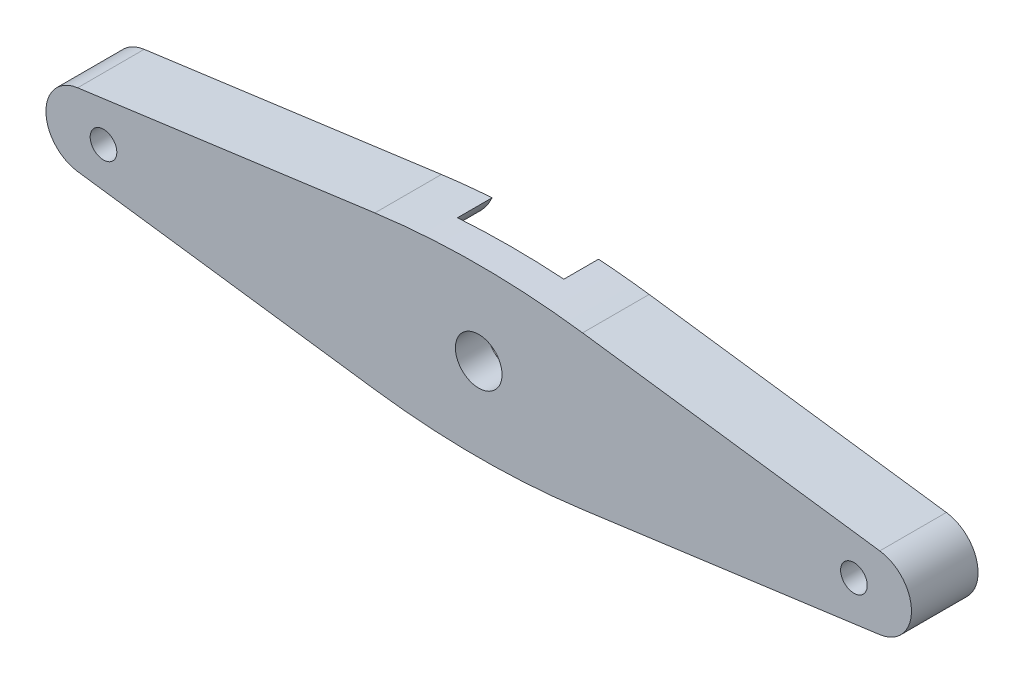
ISO-10303-21;
HEADER;
FILE_DESCRIPTION(('STEP AP214'),'2;1');
FILE_NAME('part.step','',(''),(''),'','','');
FILE_SCHEMA(('AUTOMOTIVE_DESIGN { 1 0 10303 214 1 1 1 1 }'));
ENDSEC;
DATA;
#1=APPLICATION_CONTEXT('core data for automotive mechanical design processes');
#2=APPLICATION_PROTOCOL_DEFINITION('international standard','automotive_design',2000,#1);
#3=PRODUCT_CONTEXT('',#1,'mechanical');
#4=PRODUCT('Part','Part','',(#3));
#5=PRODUCT_RELATED_PRODUCT_CATEGORY('part','',(#4));
#6=PRODUCT_DEFINITION_FORMATION('','',#4);
#7=PRODUCT_DEFINITION_CONTEXT('part definition',#1,'design');
#8=PRODUCT_DEFINITION('design','',#6,#7);
#9=PRODUCT_DEFINITION_SHAPE('','',#8);
#10=(LENGTH_UNIT() NAMED_UNIT(*) SI_UNIT(.MILLI.,.METRE.));
#11=(NAMED_UNIT(*) PLANE_ANGLE_UNIT() SI_UNIT($,.RADIAN.));
#12=(NAMED_UNIT(*) SI_UNIT($,.STERADIAN.) SOLID_ANGLE_UNIT());
#13=UNCERTAINTY_MEASURE_WITH_UNIT(LENGTH_MEASURE(1.E-05),#10,'distance_accuracy_value','');
#14=(GEOMETRIC_REPRESENTATION_CONTEXT(3) GLOBAL_UNCERTAINTY_ASSIGNED_CONTEXT((#13)) GLOBAL_UNIT_ASSIGNED_CONTEXT((#10,
#11,#12)) REPRESENTATION_CONTEXT('',''));
#15=CARTESIAN_POINT('',(0.,0.,0.));
#16=DIRECTION('',(0.,0.,1.));
#17=DIRECTION('',(1.,0.,0.));
#18=AXIS2_PLACEMENT_3D('',#15,#16,#17);
#19=CARTESIAN_POINT('',(18.0000000000003,51.9098389957868,0.));
#20=DIRECTION('',(0.,0.,1.));
#21=DIRECTION('',(1.,0.,0.));
#22=AXIS2_PLACEMENT_3D('',#19,#20,#21);
#23=PLANE('',#22);
#24=CARTESIAN_POINT('',(-10.1769846841459,0.,0.));
#25=DIRECTION('',(0.,0.,1.));
#26=DIRECTION('',(1.,0.,0.));
#27=AXIS2_PLACEMENT_3D('',#24,#25,#26);
#28=CIRCLE('',#27,1.);
#29=CARTESIAN_POINT('',(-9.17698468414593,0.,0.));
#30=VERTEX_POINT('',#29);
#31=EDGE_CURVE('E338',#30,#30,#28,.T.);
#32=ORIENTED_EDGE('',*,*,#31,.T.);
#33=EDGE_LOOP('',(#32));
#34=FACE_BOUND('',#33,.T.);
#35=CARTESIAN_POINT('',(17.9999999999999,-51.9098389957837,0.));
#36=DIRECTION('',(0.,0.,1.));
#37=DIRECTION('',(-1.,0.,0.));
#38=AXIS2_PLACEMENT_3D('',#35,#36,#37);
#39=CIRCLE('',#38,58.179875130031);
#40=CARTESIAN_POINT('',(14.0047957534816,6.13269896711555,0.));
#41=VERTEX_POINT('',#40);
#42=CARTESIAN_POINT('',(10.1995611723666,5.74474472695557,0.));
#43=VERTEX_POINT('',#42);
#44=EDGE_CURVE('E155',#41,#43,#39,.T.);
#45=ORIENTED_EDGE('',*,*,#44,.F.);
#46=CARTESIAN_POINT('',(10.2010065883518,7.79899341164945,0.));
#47=DIRECTION('',(0.,0.,1.));
#48=DIRECTION('',(1.,0.,0.));
#49=AXIS2_PLACEMENT_3D('',#46,#47,#48);
#50=CIRCLE('',#49,4.15275200182277);
#51=CARTESIAN_POINT('',(11.0515587976835,3.73427815374466,0.));
#52=VERTEX_POINT('',#51);
#53=EDGE_CURVE('E304',#52,#41,#50,.T.);
#54=ORIENTED_EDGE('',*,*,#53,.F.);
#55=DIRECTION('',(-0.978800384930441,-0.20481651901158,0.));
#56=VECTOR('',#55,1.);
#57=CARTESIAN_POINT('',(11.0515587976836,3.73427815374461,0.));
#58=LINE('',#57,#56);
#59=CARTESIAN_POINT('',(1.39157109173227,1.71290067362827,0.));
#60=VERTEX_POINT('',#59);
#61=EDGE_CURVE('E301',#52,#60,#58,.T.);
#62=ORIENTED_EDGE('',*,*,#61,.T.);
#63=CARTESIAN_POINT('',(1.75000000000253,0.,0.));
#64=DIRECTION('',(0.,0.,1.));
#65=DIRECTION('',(1.,0.,0.));
#66=AXIS2_PLACEMENT_3D('',#63,#64,#65);
#67=CIRCLE('',#66,1.75);
#68=CARTESIAN_POINT('',(1.39157109173227,-1.71290067362827,0.));
#69=VERTEX_POINT('',#68);
#70=EDGE_CURVE('E294',#60,#69,#67,.T.);
#71=ORIENTED_EDGE('',*,*,#70,.T.);
#72=DIRECTION('',(-0.978800384930439,0.204816519011589,0.));
#73=VECTOR('',#72,1.);
#74=CARTESIAN_POINT('',(11.0515587976835,-3.7342781537447,0.));
#75=LINE('',#74,#73);
#76=CARTESIAN_POINT('',(11.0515587976835,-3.7342781537447,0.));
#77=VERTEX_POINT('',#76);
#78=EDGE_CURVE('E292',#77,#69,#75,.T.);
#79=ORIENTED_EDGE('',*,*,#78,.F.);
#80=CARTESIAN_POINT('',(10.2010065883518,-7.79899341164949,0.));
#81=DIRECTION('',(0.,0.,1.));
#82=DIRECTION('',(1.,0.,0.));
#83=AXIS2_PLACEMENT_3D('',#80,#81,#82);
#84=CIRCLE('',#83,4.15275200182279);
#85=CARTESIAN_POINT('',(14.0047957534815,-6.13269896711555,0.));
#86=VERTEX_POINT('',#85);
#87=EDGE_CURVE('E288',#86,#77,#84,.T.);
#88=ORIENTED_EDGE('',*,*,#87,.F.);
#89=CARTESIAN_POINT('',(18.0000000000003,51.9098389957868,0.));
#90=DIRECTION('',(0.,0.,1.));
#91=DIRECTION('',(1.,0.,0.));
#92=AXIS2_PLACEMENT_3D('',#89,#90,#91);
#93=CIRCLE('',#92,58.1798751300342);
#94=CARTESIAN_POINT('',(10.1995611723666,-5.74474472695556,0.));
#95=VERTEX_POINT('',#94);
#96=EDGE_CURVE('E145',#95,#86,#93,.T.);
#97=ORIENTED_EDGE('',*,*,#96,.F.);
#98=DIRECTION('',(0.99097125241129,-0.134074519929776,0.));
#99=VECTOR('',#98,1.);
#100=CARTESIAN_POINT('',(-12.1187049298069,-2.72517094413105,0.));
#101=LINE('',#100,#99);
#102=CARTESIAN_POINT('',(-12.1187049298069,-2.72517094413105,0.));
#103=VERTEX_POINT('',#102);
#104=EDGE_CURVE('E92',#103,#95,#101,.T.);
#105=ORIENTED_EDGE('',*,*,#104,.F.);
#106=CARTESIAN_POINT('',(-11.75,0.,0.));
#107=DIRECTION('',(0.,0.,1.));
#108=DIRECTION('',(1.,0.,0.));
#109=AXIS2_PLACEMENT_3D('',#106,#107,#108);
#110=CIRCLE('',#109,2.75);
#111=CARTESIAN_POINT('',(-12.1187049298069,2.72517094413105,0.));
#112=VERTEX_POINT('',#111);
#113=EDGE_CURVE('E160',#112,#103,#110,.T.);
#114=ORIENTED_EDGE('',*,*,#113,.F.);
#115=DIRECTION('',(-0.99097125241129,-0.134074519929776,0.));
#116=VECTOR('',#115,1.);
#117=CARTESIAN_POINT('',(-12.1187049298069,2.72517094413105,0.));
#118=LINE('',#117,#116);
#119=EDGE_CURVE('E133',#43,#112,#118,.T.);
#120=ORIENTED_EDGE('',*,*,#119,.F.);
#121=EDGE_LOOP('',(#45,#54,#62,#71,#79,#88,#97,#105,#114,#120));
#122=FACE_BOUND('',#121,.T.);
#123=ADVANCED_FACE('F34',(#34,#122),#23,.F.);
#124=CARTESIAN_POINT('',(18.0000000000003,51.9098389957868,5.));
#125=DIRECTION('',(0.,0.,1.));
#126=DIRECTION('',(1.,0.,0.));
#127=AXIS2_PLACEMENT_3D('',#124,#125,#126);
#128=PLANE('',#127);
#129=CARTESIAN_POINT('',(-10.1769846841459,0.,5.));
#130=DIRECTION('',(0.,0.,1.));
#131=DIRECTION('',(1.,0.,0.));
#132=AXIS2_PLACEMENT_3D('',#129,#130,#131);
#133=CIRCLE('',#132,1.);
#134=CARTESIAN_POINT('',(-9.17698468414593,0.,5.));
#135=VERTEX_POINT('',#134);
#136=EDGE_CURVE('E430',#135,#135,#133,.T.);
#137=ORIENTED_EDGE('',*,*,#136,.F.);
#138=EDGE_LOOP('',(#137));
#139=FACE_BOUND('',#138,.T.);
#140=CARTESIAN_POINT('',(46.1769846841459,0.,5.));
#141=DIRECTION('',(0.,0.,1.));
#142=DIRECTION('',(-1.,0.,0.));
#143=AXIS2_PLACEMENT_3D('',#140,#141,#142);
#144=CIRCLE('',#143,0.999999999999998);
#145=CARTESIAN_POINT('',(45.1769846841459,0.,5.));
#146=VERTEX_POINT('',#145);
#147=EDGE_CURVE('E432',#146,#146,#144,.T.);
#148=ORIENTED_EDGE('',*,*,#147,.F.);
#149=EDGE_LOOP('',(#148));
#150=FACE_BOUND('',#149,.T.);
#151=CARTESIAN_POINT('',(18.0000000000003,51.9098389957868,5.));
#152=DIRECTION('',(0.,0.,1.));
#153=DIRECTION('',(1.,0.,0.));
#154=AXIS2_PLACEMENT_3D('',#151,#152,#153);
#155=CIRCLE('',#154,58.1798751300342);
#156=CARTESIAN_POINT('',(10.1995611723666,-5.74474472695556,5.));
#157=VERTEX_POINT('',#156);
#158=CARTESIAN_POINT('',(25.8004388276333,-5.74474472695563,5.));
#159=VERTEX_POINT('',#158);
#160=EDGE_CURVE('E163',#157,#159,#155,.T.);
#161=ORIENTED_EDGE('',*,*,#160,.T.);
#162=DIRECTION('',(0.990971252411291,0.134074519929769,0.));
#163=VECTOR('',#162,1.);
#164=CARTESIAN_POINT('',(48.1187049298069,-2.72517094413126,5.));
#165=LINE('',#164,#163);
#166=CARTESIAN_POINT('',(48.1187049298069,-2.72517094413126,5.));
#167=VERTEX_POINT('',#166);
#168=EDGE_CURVE('E101',#159,#167,#165,.T.);
#169=ORIENTED_EDGE('',*,*,#168,.T.);
#170=CARTESIAN_POINT('',(47.75,-2.08684625209121E-13,5.));
#171=DIRECTION('',(0.,0.,1.));
#172=DIRECTION('',(1.,0.,0.));
#173=AXIS2_PLACEMENT_3D('',#170,#171,#172);
#174=CIRCLE('',#173,2.75);
#175=CARTESIAN_POINT('',(48.1187049298069,2.72517094413083,5.));
#176=VERTEX_POINT('',#175);
#177=EDGE_CURVE('E224',#167,#176,#174,.T.);
#178=ORIENTED_EDGE('',*,*,#177,.T.);
#179=DIRECTION('',(-0.990971252411289,0.134074519929783,0.));
#180=VECTOR('',#179,1.);
#181=CARTESIAN_POINT('',(48.1187049298069,2.72517094413083,5.));
#182=LINE('',#181,#180);
#183=CARTESIAN_POINT('',(25.8004388276334,5.74474472695551,5.));
#184=VERTEX_POINT('',#183);
#185=EDGE_CURVE('E226',#176,#184,#182,.T.);
#186=ORIENTED_EDGE('',*,*,#185,.T.);
#187=CARTESIAN_POINT('',(17.9999999999999,-51.9098389957837,5.));
#188=DIRECTION('',(0.,0.,1.));
#189=DIRECTION('',(-1.,0.,0.));
#190=AXIS2_PLACEMENT_3D('',#187,#188,#189);
#191=CIRCLE('',#190,58.179875130031);
#192=CARTESIAN_POINT('',(10.1995611723666,5.74474472695557,5.));
#193=VERTEX_POINT('',#192);
#194=EDGE_CURVE('E124',#184,#193,#191,.T.);
#195=ORIENTED_EDGE('',*,*,#194,.T.);
#196=DIRECTION('',(-0.99097125241129,-0.134074519929776,0.));
#197=VECTOR('',#196,1.);
#198=CARTESIAN_POINT('',(-12.1187049298069,2.72517094413105,5.));
#199=LINE('',#198,#197);
#200=CARTESIAN_POINT('',(-12.1187049298069,2.72517094413105,5.));
#201=VERTEX_POINT('',#200);
#202=EDGE_CURVE('E116',#193,#201,#199,.T.);
#203=ORIENTED_EDGE('',*,*,#202,.T.);
#204=CARTESIAN_POINT('',(-11.75,0.,5.));
#205=DIRECTION('',(0.,0.,1.));
#206=DIRECTION('',(1.,0.,0.));
#207=AXIS2_PLACEMENT_3D('',#204,#205,#206);
#208=CIRCLE('',#207,2.75);
#209=CARTESIAN_POINT('',(-12.1187049298069,-2.72517094413105,5.));
#210=VERTEX_POINT('',#209);
#211=EDGE_CURVE('E121',#201,#210,#208,.T.);
#212=ORIENTED_EDGE('',*,*,#211,.T.);
#213=DIRECTION('',(0.99097125241129,-0.134074519929776,0.));
#214=VECTOR('',#213,1.);
#215=CARTESIAN_POINT('',(-12.1187049298069,-2.72517094413105,5.));
#216=LINE('',#215,#214);
#217=EDGE_CURVE('E59',#210,#157,#216,.T.);
#218=ORIENTED_EDGE('',*,*,#217,.T.);
#219=EDGE_LOOP('',(#161,#169,#178,#186,#195,#203,#212,#218));
#220=FACE_BOUND('',#219,.T.);
#221=CARTESIAN_POINT('',(18.,0.,5.));
#222=DIRECTION('',(0.,0.,1.));
#223=DIRECTION('',(1.,0.,0.));
#224=AXIS2_PLACEMENT_3D('',#221,#222,#223);
#225=CIRCLE('',#224,1.75);
#226=CARTESIAN_POINT('',(19.75,0.,5.));
#227=VERTEX_POINT('',#226);
#228=EDGE_CURVE('E214',#227,#227,#225,.T.);
#229=ORIENTED_EDGE('',*,*,#228,.F.);
#230=EDGE_LOOP('',(#229));
#231=FACE_BOUND('',#230,.T.);
#232=ADVANCED_FACE('F118',(#139,#150,#220,#231),#128,.T.);
#233=CARTESIAN_POINT('',(46.1769846841459,0.,0.));
#234=DIRECTION('',(0.,0.,1.));
#235=DIRECTION('',(1.,0.,0.));
#236=AXIS2_PLACEMENT_3D('',#233,#234,#235);
#237=CIRCLE('',#236,0.999999999999998);
#238=CARTESIAN_POINT('',(47.1769846841459,0.,0.));
#239=VERTEX_POINT('',#238);
#240=EDGE_CURVE('E38',#239,#239,#237,.T.);
#241=ORIENTED_EDGE('',*,*,#240,.T.);
#242=EDGE_LOOP('',(#241));
#243=FACE_BOUND('',#242,.T.);
#244=DIRECTION('',(0.978800384930441,-0.204816519011576,0.));
#245=VECTOR('',#244,1.);
#246=CARTESIAN_POINT('',(24.948441202319,3.73427815374457,0.));
#247=LINE('',#246,#245);
#248=CARTESIAN_POINT('',(24.948441202319,3.73427815374457,0.));
#249=VERTEX_POINT('',#248);
#250=CARTESIAN_POINT('',(34.6084289082703,1.71290067362827,0.));
#251=VERTEX_POINT('',#250);
#252=EDGE_CURVE('E356',#249,#251,#247,.T.);
#253=ORIENTED_EDGE('',*,*,#252,.F.);
#254=CARTESIAN_POINT('',(25.7989934116507,7.79899341164945,0.));
#255=DIRECTION('',(0.,0.,1.));
#256=DIRECTION('',(1.,0.,0.));
#257=AXIS2_PLACEMENT_3D('',#254,#255,#256);
#258=CIRCLE('',#257,4.1527520018228);
#259=CARTESIAN_POINT('',(21.995204246521,6.13269896711535,0.));
#260=VERTEX_POINT('',#259);
#261=EDGE_CURVE('E249',#260,#249,#258,.T.);
#262=ORIENTED_EDGE('',*,*,#261,.F.);
#263=CARTESIAN_POINT('',(25.8004388276334,5.74474472695551,0.));
#264=VERTEX_POINT('',#263);
#265=EDGE_CURVE('E156',#264,#260,#39,.T.);
#266=ORIENTED_EDGE('',*,*,#265,.F.);
#267=DIRECTION('',(-0.990971252411289,0.134074519929783,0.));
#268=VECTOR('',#267,1.);
#269=CARTESIAN_POINT('',(48.1187049298069,2.72517094413083,0.));
#270=LINE('',#269,#268);
#271=CARTESIAN_POINT('',(48.1187049298069,2.72517094413083,0.));
#272=VERTEX_POINT('',#271);
#273=EDGE_CURVE('E153',#272,#264,#270,.T.);
#274=ORIENTED_EDGE('',*,*,#273,.F.);
#275=CARTESIAN_POINT('',(47.75,-2.08684625209121E-13,0.));
#276=DIRECTION('',(0.,0.,1.));
#277=DIRECTION('',(1.,0.,0.));
#278=AXIS2_PLACEMENT_3D('',#275,#276,#277);
#279=CIRCLE('',#278,2.75);
#280=CARTESIAN_POINT('',(48.1187049298069,-2.72517094413126,0.));
#281=VERTEX_POINT('',#280);
#282=EDGE_CURVE('E151',#281,#272,#279,.T.);
#283=ORIENTED_EDGE('',*,*,#282,.F.);
#284=DIRECTION('',(0.990971252411291,0.134074519929769,0.));
#285=VECTOR('',#284,1.);
#286=CARTESIAN_POINT('',(48.1187049298069,-2.72517094413126,0.));
#287=LINE('',#286,#285);
#288=CARTESIAN_POINT('',(25.8004388276333,-5.74474472695563,0.));
#289=VERTEX_POINT('',#288);
#290=EDGE_CURVE('E148',#289,#281,#287,.T.);
#291=ORIENTED_EDGE('',*,*,#290,.F.);
#292=CARTESIAN_POINT('',(21.995204246521,-6.13269896711542,0.));
#293=VERTEX_POINT('',#292);
#294=EDGE_CURVE('E149',#293,#289,#93,.T.);
#295=ORIENTED_EDGE('',*,*,#294,.F.);
#296=CARTESIAN_POINT('',(25.7989934116507,-7.79899341164945,0.));
#297=DIRECTION('',(0.,0.,1.));
#298=DIRECTION('',(1.,0.,0.));
#299=AXIS2_PLACEMENT_3D('',#296,#297,#298);
#300=CIRCLE('',#299,4.1527520018228);
#301=CARTESIAN_POINT('',(24.948441202319,-3.73427815374463,0.));
#302=VERTEX_POINT('',#301);
#303=EDGE_CURVE('E212',#302,#293,#300,.T.);
#304=ORIENTED_EDGE('',*,*,#303,.F.);
#305=DIRECTION('',(0.978800384930441,0.204816519011576,0.));
#306=VECTOR('',#305,1.);
#307=CARTESIAN_POINT('',(24.948441202319,-3.73427815374457,0.));
#308=LINE('',#307,#306);
#309=CARTESIAN_POINT('',(34.6084289082703,-1.71290067362827,0.));
#310=VERTEX_POINT('',#309);
#311=EDGE_CURVE('E296',#302,#310,#308,.T.);
#312=ORIENTED_EDGE('',*,*,#311,.T.);
#313=CARTESIAN_POINT('',(34.25,0.,0.));
#314=DIRECTION('',(0.,0.,1.));
#315=DIRECTION('',(1.,0.,0.));
#316=AXIS2_PLACEMENT_3D('',#313,#314,#315);
#317=CIRCLE('',#316,1.75);
#318=EDGE_CURVE('E359',#310,#251,#317,.T.);
#319=ORIENTED_EDGE('',*,*,#318,.T.);
#320=EDGE_LOOP('',(#253,#262,#266,#274,#283,#291,#295,#304,#312,#319));
#321=FACE_BOUND('',#320,.T.);
#322=ADVANCED_FACE('F209',(#243,#321),#23,.F.);
#323=CARTESIAN_POINT('',(18.0000000000003,51.9098389957868,5.));
#324=DIRECTION('',(0.,0.,-1.));
#325=DIRECTION('',(-1.,0.,0.));
#326=AXIS2_PLACEMENT_3D('',#323,#324,#325);
#327=CYLINDRICAL_SURFACE('',#326,58.1798751300342);
#328=ORIENTED_EDGE('',*,*,#96,.T.);
#329=DIRECTION('',(0.,0.,-1.));
#330=VECTOR('',#329,1.);
#331=CARTESIAN_POINT('',(14.0047957534815,-6.13269896711552,1.3));
#332=LINE('',#331,#330);
#333=CARTESIAN_POINT('',(14.0047957534815,-6.13269896711555,2.6));
#334=VERTEX_POINT('',#333);
#335=EDGE_CURVE('E11',#86,#334,#332,.F.);
#336=ORIENTED_EDGE('',*,*,#335,.T.);
#337=CARTESIAN_POINT('',(18.0000000000003,51.9098389957868,2.6));
#338=DIRECTION('',(0.,0.,1.));
#339=DIRECTION('',(1.,0.,0.));
#340=AXIS2_PLACEMENT_3D('',#337,#338,#339);
#341=CIRCLE('',#340,58.1798751300342);
#342=CARTESIAN_POINT('',(21.995204246521,-6.13269896711542,2.6));
#343=VERTEX_POINT('',#342);
#344=EDGE_CURVE('E198',#334,#343,#341,.T.);
#345=ORIENTED_EDGE('',*,*,#344,.T.);
#346=DIRECTION('',(0.,0.,-1.));
#347=VECTOR('',#346,1.);
#348=CARTESIAN_POINT('',(21.995204246521,-6.13269896711544,1.3));
#349=LINE('',#348,#347);
#350=EDGE_CURVE('E43',#343,#293,#349,.T.);
#351=ORIENTED_EDGE('',*,*,#350,.T.);
#352=ORIENTED_EDGE('',*,*,#294,.T.);
#353=DIRECTION('',(0.,0.,-1.));
#354=VECTOR('',#353,1.);
#355=CARTESIAN_POINT('',(25.8004388276333,-5.74474472695563,5.));
#356=LINE('',#355,#354);
#357=EDGE_CURVE('E176',#159,#289,#356,.T.);
#358=ORIENTED_EDGE('',*,*,#357,.F.);
#359=ORIENTED_EDGE('',*,*,#160,.F.);
#360=DIRECTION('',(0.,0.,-1.));
#361=VECTOR('',#360,1.);
#362=CARTESIAN_POINT('',(10.1995611723666,-5.74474472695556,5.));
#363=LINE('',#362,#361);
#364=EDGE_CURVE('E141',#157,#95,#363,.T.);
#365=ORIENTED_EDGE('',*,*,#364,.T.);
#366=EDGE_LOOP('',(#328,#336,#345,#351,#352,#358,#359,#365));
#367=FACE_BOUND('',#366,.T.);
#368=ADVANCED_FACE('F36',(#367),#327,.T.);
#369=CARTESIAN_POINT('',(48.1187049298069,-2.72517094413126,5.));
#370=DIRECTION('',(-0.134074519929769,0.99097125241129,0.));
#371=DIRECTION('',(-0.990971252411291,-0.134074519929769,0.));
#372=AXIS2_PLACEMENT_3D('',#369,#370,#371);
#373=PLANE('',#372);
#374=ORIENTED_EDGE('',*,*,#290,.T.);
#375=DIRECTION('',(0.,0.,-1.));
#376=VECTOR('',#375,1.);
#377=CARTESIAN_POINT('',(48.1187049298069,-2.72517094413126,5.));
#378=LINE('',#377,#376);
#379=EDGE_CURVE('E173',#167,#281,#378,.T.);
#380=ORIENTED_EDGE('',*,*,#379,.F.);
#381=ORIENTED_EDGE('',*,*,#168,.F.);
#382=ORIENTED_EDGE('',*,*,#357,.T.);
#383=EDGE_LOOP('',(#374,#380,#381,#382));
#384=FACE_BOUND('',#383,.T.);
#385=ADVANCED_FACE('F244',(#384),#373,.F.);
#386=CARTESIAN_POINT('',(47.75,-2.08684625209121E-13,5.));
#387=DIRECTION('',(0.,0.,-1.));
#388=DIRECTION('',(-1.,0.,0.));
#389=AXIS2_PLACEMENT_3D('',#386,#387,#388);
#390=CYLINDRICAL_SURFACE('',#389,2.75);
#391=ORIENTED_EDGE('',*,*,#282,.T.);
#392=DIRECTION('',(0.,0.,-1.));
#393=VECTOR('',#392,1.);
#394=CARTESIAN_POINT('',(48.1187049298069,2.72517094413083,5.));
#395=LINE('',#394,#393);
#396=EDGE_CURVE('E170',#176,#272,#395,.T.);
#397=ORIENTED_EDGE('',*,*,#396,.F.);
#398=ORIENTED_EDGE('',*,*,#177,.F.);
#399=ORIENTED_EDGE('',*,*,#379,.T.);
#400=EDGE_LOOP('',(#391,#397,#398,#399));
#401=FACE_BOUND('',#400,.T.);
#402=ADVANCED_FACE('F246',(#401),#390,.T.);
#403=CARTESIAN_POINT('',(48.1187049298069,2.72517094413083,5.));
#404=DIRECTION('',(-0.134074519929783,-0.990971252411289,0.));
#405=DIRECTION('',(0.990971252411289,-0.134074519929783,0.));
#406=AXIS2_PLACEMENT_3D('',#403,#404,#405);
#407=PLANE('',#406);
#408=ORIENTED_EDGE('',*,*,#273,.T.);
#409=DIRECTION('',(0.,0.,-1.));
#410=VECTOR('',#409,1.);
#411=CARTESIAN_POINT('',(25.8004388276334,5.74474472695551,5.));
#412=LINE('',#411,#410);
#413=EDGE_CURVE('E167',#184,#264,#412,.T.);
#414=ORIENTED_EDGE('',*,*,#413,.F.);
#415=ORIENTED_EDGE('',*,*,#185,.F.);
#416=ORIENTED_EDGE('',*,*,#396,.T.);
#417=EDGE_LOOP('',(#408,#414,#415,#416));
#418=FACE_BOUND('',#417,.T.);
#419=ADVANCED_FACE('F232',(#418),#407,.F.);
#420=CARTESIAN_POINT('',(17.9999999999999,-51.9098389957837,5.));
#421=DIRECTION('',(0.,0.,-1.));
#422=DIRECTION('',(-1.,0.,0.));
#423=AXIS2_PLACEMENT_3D('',#420,#421,#422);
#424=CYLINDRICAL_SURFACE('',#423,58.179875130031);
#425=ORIENTED_EDGE('',*,*,#265,.T.);
#426=DIRECTION('',(0.,0.,-1.));
#427=VECTOR('',#426,1.);
#428=CARTESIAN_POINT('',(21.995204246521,6.13269896711534,1.3));
#429=LINE('',#428,#427);
#430=CARTESIAN_POINT('',(21.995204246521,6.13269896711535,2.6));
#431=VERTEX_POINT('',#430);
#432=EDGE_CURVE('E186',#260,#431,#429,.F.);
#433=ORIENTED_EDGE('',*,*,#432,.T.);
#434=CARTESIAN_POINT('',(17.9999999999999,-51.9098389957837,2.6));
#435=DIRECTION('',(0.,0.,1.));
#436=DIRECTION('',(1.,0.,0.));
#437=AXIS2_PLACEMENT_3D('',#434,#435,#436);
#438=CIRCLE('',#437,58.179875130031);
#439=CARTESIAN_POINT('',(14.0047957534816,6.13269896711555,2.6));
#440=VERTEX_POINT('',#439);
#441=EDGE_CURVE('E182',#431,#440,#438,.T.);
#442=ORIENTED_EDGE('',*,*,#441,.T.);
#443=DIRECTION('',(0.,0.,-1.));
#444=VECTOR('',#443,1.);
#445=CARTESIAN_POINT('',(14.0047957534816,6.13269896711556,1.3));
#446=LINE('',#445,#444);
#447=EDGE_CURVE('E178',#440,#41,#446,.T.);
#448=ORIENTED_EDGE('',*,*,#447,.T.);
#449=ORIENTED_EDGE('',*,*,#44,.T.);
#450=DIRECTION('',(0.,0.,-1.));
#451=VECTOR('',#450,1.);
#452=CARTESIAN_POINT('',(10.1995611723666,5.74474472695557,5.));
#453=LINE('',#452,#451);
#454=EDGE_CURVE('E136',#193,#43,#453,.T.);
#455=ORIENTED_EDGE('',*,*,#454,.F.);
#456=ORIENTED_EDGE('',*,*,#194,.F.);
#457=ORIENTED_EDGE('',*,*,#413,.T.);
#458=EDGE_LOOP('',(#425,#433,#442,#448,#449,#455,#456,#457));
#459=FACE_BOUND('',#458,.T.);
#460=ADVANCED_FACE('F236',(#459),#424,.T.);
#461=CARTESIAN_POINT('',(-12.1187049298069,2.72517094413105,5.));
#462=DIRECTION('',(0.134074519929776,-0.99097125241129,0.));
#463=DIRECTION('',(0.99097125241129,0.134074519929776,0.));
#464=AXIS2_PLACEMENT_3D('',#461,#462,#463);
#465=PLANE('',#464);
#466=ORIENTED_EDGE('',*,*,#119,.T.);
#467=DIRECTION('',(0.,0.,-1.));
#468=VECTOR('',#467,1.);
#469=CARTESIAN_POINT('',(-12.1187049298069,2.72517094413105,5.));
#470=LINE('',#469,#468);
#471=EDGE_CURVE('E130',#201,#112,#470,.T.);
#472=ORIENTED_EDGE('',*,*,#471,.F.);
#473=ORIENTED_EDGE('',*,*,#202,.F.);
#474=ORIENTED_EDGE('',*,*,#454,.T.);
#475=EDGE_LOOP('',(#466,#472,#473,#474));
#476=FACE_BOUND('',#475,.T.);
#477=ADVANCED_FACE('F131',(#476),#465,.F.);
#478=CARTESIAN_POINT('',(-11.75,0.,5.));
#479=DIRECTION('',(0.,0.,-1.));
#480=DIRECTION('',(-1.,0.,0.));
#481=AXIS2_PLACEMENT_3D('',#478,#479,#480);
#482=CYLINDRICAL_SURFACE('',#481,2.75);
#483=ORIENTED_EDGE('',*,*,#113,.T.);
#484=DIRECTION('',(0.,0.,-1.));
#485=VECTOR('',#484,1.);
#486=CARTESIAN_POINT('',(-12.1187049298069,-2.72517094413105,5.));
#487=LINE('',#486,#485);
#488=EDGE_CURVE('E137',#210,#103,#487,.T.);
#489=ORIENTED_EDGE('',*,*,#488,.F.);
#490=ORIENTED_EDGE('',*,*,#211,.F.);
#491=ORIENTED_EDGE('',*,*,#471,.T.);
#492=EDGE_LOOP('',(#483,#489,#490,#491));
#493=FACE_BOUND('',#492,.T.);
#494=ADVANCED_FACE('F139',(#493),#482,.T.);
#495=CARTESIAN_POINT('',(-12.1187049298069,-2.72517094413105,5.));
#496=DIRECTION('',(0.134074519929776,0.99097125241129,0.));
#497=DIRECTION('',(-0.99097125241129,0.134074519929776,0.));
#498=AXIS2_PLACEMENT_3D('',#495,#496,#497);
#499=PLANE('',#498);
#500=ORIENTED_EDGE('',*,*,#104,.T.);
#501=ORIENTED_EDGE('',*,*,#364,.F.);
#502=ORIENTED_EDGE('',*,*,#217,.F.);
#503=ORIENTED_EDGE('',*,*,#488,.T.);
#504=EDGE_LOOP('',(#500,#501,#502,#503));
#505=FACE_BOUND('',#504,.T.);
#506=ADVANCED_FACE('F242',(#505),#499,.F.);
#507=CARTESIAN_POINT('',(18.,0.,5.));
#508=DIRECTION('',(0.,0.,-1.));
#509=DIRECTION('',(-1.,0.,0.));
#510=AXIS2_PLACEMENT_3D('',#507,#508,#509);
#511=CYLINDRICAL_SURFACE('',#510,1.75);
#512=CARTESIAN_POINT('',(18.,0.,2.6));
#513=DIRECTION('',(0.,0.,1.));
#514=DIRECTION('',(1.,0.,0.));
#515=AXIS2_PLACEMENT_3D('',#512,#513,#514);
#516=CIRCLE('',#515,1.75);
#517=CARTESIAN_POINT('',(19.75,0.,2.6));
#518=VERTEX_POINT('',#517);
#519=EDGE_CURVE('E179',#518,#518,#516,.T.);
#520=ORIENTED_EDGE('',*,*,#519,.F.);
#521=EDGE_LOOP('',(#520));
#522=FACE_BOUND('',#521,.T.);
#523=ORIENTED_EDGE('',*,*,#228,.T.);
#524=EDGE_LOOP('',(#523));
#525=FACE_BOUND('',#524,.T.);
#526=ADVANCED_FACE('F409',(#522,#525),#511,.F.);
#527=CARTESIAN_POINT('',(10.2010065883518,-7.79899341164949,2.6));
#528=DIRECTION('',(0.,0.,-1.));
#529=DIRECTION('',(-1.,0.,0.));
#530=AXIS2_PLACEMENT_3D('',#527,#528,#529);
#531=CYLINDRICAL_SURFACE('',#530,4.15275200182279);
#532=ORIENTED_EDGE('',*,*,#87,.T.);
#533=DIRECTION('',(0.,0.,-1.));
#534=VECTOR('',#533,1.);
#535=CARTESIAN_POINT('',(11.0515587976835,-3.7342781537447,2.6));
#536=LINE('',#535,#534);
#537=CARTESIAN_POINT('',(11.0515587976835,-3.7342781537447,2.6));
#538=VERTEX_POINT('',#537);
#539=EDGE_CURVE('E283',#538,#77,#536,.T.);
#540=ORIENTED_EDGE('',*,*,#539,.F.);
#541=CARTESIAN_POINT('',(10.2010065883518,-7.79899341164949,2.6));
#542=DIRECTION('',(0.,0.,1.));
#543=DIRECTION('',(1.,0.,0.));
#544=AXIS2_PLACEMENT_3D('',#541,#542,#543);
#545=CIRCLE('',#544,4.15275200182279);
#546=EDGE_CURVE('E274',#334,#538,#545,.T.);
#547=ORIENTED_EDGE('',*,*,#546,.F.);
#548=ORIENTED_EDGE('',*,*,#335,.F.);
#549=EDGE_LOOP('',(#532,#540,#547,#548));
#550=FACE_BOUND('',#549,.T.);
#551=ADVANCED_FACE('F280',(#550),#531,.T.);
#552=CARTESIAN_POINT('',(25.7989934116507,-7.79899341164945,2.6));
#553=DIRECTION('',(0.,0.,-1.));
#554=DIRECTION('',(-1.,0.,0.));
#555=AXIS2_PLACEMENT_3D('',#552,#553,#554);
#556=CYLINDRICAL_SURFACE('',#555,4.1527520018228);
#557=CARTESIAN_POINT('',(25.7989934116507,-7.79899341164945,2.6));
#558=DIRECTION('',(0.,0.,1.));
#559=DIRECTION('',(1.,0.,0.));
#560=AXIS2_PLACEMENT_3D('',#557,#558,#559);
#561=CIRCLE('',#560,4.1527520018228);
#562=CARTESIAN_POINT('',(24.948441202319,-3.73427815374463,2.6));
#563=VERTEX_POINT('',#562);
#564=EDGE_CURVE('E277',#563,#343,#561,.T.);
#565=ORIENTED_EDGE('',*,*,#564,.F.);
#566=DIRECTION('',(0.,0.,-1.));
#567=VECTOR('',#566,1.);
#568=CARTESIAN_POINT('',(24.948441202319,-3.73427815374463,2.6));
#569=LINE('',#568,#567);
#570=EDGE_CURVE('E316',#563,#302,#569,.T.);
#571=ORIENTED_EDGE('',*,*,#570,.T.);
#572=ORIENTED_EDGE('',*,*,#303,.T.);
#573=ORIENTED_EDGE('',*,*,#350,.F.);
#574=EDGE_LOOP('',(#565,#571,#572,#573));
#575=FACE_BOUND('',#574,.T.);
#576=ADVANCED_FACE('F400',(#575),#556,.T.);
#577=CARTESIAN_POINT('',(25.7989934116507,7.79899341164945,2.6));
#578=DIRECTION('',(0.,0.,-1.));
#579=DIRECTION('',(-1.,0.,0.));
#580=AXIS2_PLACEMENT_3D('',#577,#578,#579);
#581=CYLINDRICAL_SURFACE('',#580,4.1527520018228);
#582=ORIENTED_EDGE('',*,*,#261,.T.);
#583=DIRECTION('',(0.,0.,-1.));
#584=VECTOR('',#583,1.);
#585=CARTESIAN_POINT('',(24.948441202319,3.73427815374457,2.6));
#586=LINE('',#585,#584);
#587=CARTESIAN_POINT('',(24.948441202319,3.73427815374457,2.6));
#588=VERTEX_POINT('',#587);
#589=EDGE_CURVE('E325',#588,#249,#586,.T.);
#590=ORIENTED_EDGE('',*,*,#589,.F.);
#591=CARTESIAN_POINT('',(25.7989934116507,7.79899341164945,2.6));
#592=DIRECTION('',(0.,0.,1.));
#593=DIRECTION('',(1.,0.,0.));
#594=AXIS2_PLACEMENT_3D('',#591,#592,#593);
#595=CIRCLE('',#594,4.1527520018228);
#596=EDGE_CURVE('E306',#431,#588,#595,.T.);
#597=ORIENTED_EDGE('',*,*,#596,.F.);
#598=ORIENTED_EDGE('',*,*,#432,.F.);
#599=EDGE_LOOP('',(#582,#590,#597,#598));
#600=FACE_BOUND('',#599,.T.);
#601=ADVANCED_FACE('F331',(#600),#581,.T.);
#602=CARTESIAN_POINT('',(10.2010065883518,7.79899341164945,2.6));
#603=DIRECTION('',(0.,0.,-1.));
#604=DIRECTION('',(-1.,0.,0.));
#605=AXIS2_PLACEMENT_3D('',#602,#603,#604);
#606=CYLINDRICAL_SURFACE('',#605,4.15275200182277);
#607=CARTESIAN_POINT('',(10.2010065883518,7.79899341164945,2.6));
#608=DIRECTION('',(0.,0.,1.));
#609=DIRECTION('',(1.,0.,0.));
#610=AXIS2_PLACEMENT_3D('',#607,#608,#609);
#611=CIRCLE('',#610,4.15275200182277);
#612=CARTESIAN_POINT('',(11.0515587976835,3.73427815374466,2.6));
#613=VERTEX_POINT('',#612);
#614=EDGE_CURVE('E50',#613,#440,#611,.T.);
#615=ORIENTED_EDGE('',*,*,#614,.F.);
#616=DIRECTION('',(0.,0.,-1.));
#617=VECTOR('',#616,1.);
#618=CARTESIAN_POINT('',(11.0515587976835,3.73427815374466,2.6));
#619=LINE('',#618,#617);
#620=EDGE_CURVE('E183',#613,#52,#619,.T.);
#621=ORIENTED_EDGE('',*,*,#620,.T.);
#622=ORIENTED_EDGE('',*,*,#53,.T.);
#623=ORIENTED_EDGE('',*,*,#447,.F.);
#624=EDGE_LOOP('',(#615,#621,#622,#623));
#625=FACE_BOUND('',#624,.T.);
#626=ADVANCED_FACE('F407',(#625),#606,.T.);
#627=CARTESIAN_POINT('',(25.7989934116507,7.79899341164945,2.6));
#628=DIRECTION('',(0.,0.,1.));
#629=DIRECTION('',(1.,0.,0.));
#630=AXIS2_PLACEMENT_3D('',#627,#628,#629);
#631=PLANE('',#630);
#632=ORIENTED_EDGE('',*,*,#519,.T.);
#633=EDGE_LOOP('',(#632));
#634=FACE_BOUND('',#633,.T.);
#635=ORIENTED_EDGE('',*,*,#546,.T.);
#636=DIRECTION('',(-0.978800384930439,0.204816519011589,0.));
#637=VECTOR('',#636,1.);
#638=CARTESIAN_POINT('',(11.0515587976835,-3.7342781537447,2.6));
#639=LINE('',#638,#637);
#640=CARTESIAN_POINT('',(1.39157109173227,-1.71290067362827,2.6));
#641=VERTEX_POINT('',#640);
#642=EDGE_CURVE('E285',#538,#641,#639,.T.);
#643=ORIENTED_EDGE('',*,*,#642,.T.);
#644=CARTESIAN_POINT('',(1.75000000000253,0.,2.6));
#645=DIRECTION('',(0.,0.,1.));
#646=DIRECTION('',(1.,0.,0.));
#647=AXIS2_PLACEMENT_3D('',#644,#645,#646);
#648=CIRCLE('',#647,1.75);
#649=CARTESIAN_POINT('',(1.39157109173227,1.71290067362827,2.6));
#650=VERTEX_POINT('',#649);
#651=EDGE_CURVE('E348',#650,#641,#648,.T.);
#652=ORIENTED_EDGE('',*,*,#651,.F.);
#653=DIRECTION('',(-0.978800384930441,-0.20481651901158,0.));
#654=VECTOR('',#653,1.);
#655=CARTESIAN_POINT('',(11.0515587976836,3.73427815374461,2.6));
#656=LINE('',#655,#654);
#657=EDGE_CURVE('E351',#613,#650,#656,.T.);
#658=ORIENTED_EDGE('',*,*,#657,.F.);
#659=ORIENTED_EDGE('',*,*,#614,.T.);
#660=ORIENTED_EDGE('',*,*,#441,.F.);
#661=ORIENTED_EDGE('',*,*,#596,.T.);
#662=DIRECTION('',(0.978800384930441,-0.204816519011576,0.));
#663=VECTOR('',#662,1.);
#664=CARTESIAN_POINT('',(24.948441202319,3.73427815374457,2.6));
#665=LINE('',#664,#663);
#666=CARTESIAN_POINT('',(34.6084289082703,1.71290067362827,2.6));
#667=VERTEX_POINT('',#666);
#668=EDGE_CURVE('E333',#588,#667,#665,.T.);
#669=ORIENTED_EDGE('',*,*,#668,.T.);
#670=CARTESIAN_POINT('',(34.25,0.,2.6));
#671=DIRECTION('',(0.,0.,1.));
#672=DIRECTION('',(1.,0.,0.));
#673=AXIS2_PLACEMENT_3D('',#670,#671,#672);
#674=CIRCLE('',#673,1.75);
#675=CARTESIAN_POINT('',(34.6084289082703,-1.71290067362827,2.6));
#676=VERTEX_POINT('',#675);
#677=EDGE_CURVE('E335',#676,#667,#674,.T.);
#678=ORIENTED_EDGE('',*,*,#677,.F.);
#679=DIRECTION('',(0.978800384930441,0.204816519011576,0.));
#680=VECTOR('',#679,1.);
#681=CARTESIAN_POINT('',(24.948441202319,-3.73427815374457,2.6));
#682=LINE('',#681,#680);
#683=EDGE_CURVE('E343',#563,#676,#682,.T.);
#684=ORIENTED_EDGE('',*,*,#683,.F.);
#685=ORIENTED_EDGE('',*,*,#564,.T.);
#686=ORIENTED_EDGE('',*,*,#344,.F.);
#687=EDGE_LOOP('',(#635,#643,#652,#658,#659,#660,#661,#669,#678,#684,#685,#686));
#688=FACE_BOUND('',#687,.T.);
#689=ADVANCED_FACE('F271',(#634,#688),#631,.F.);
#690=CARTESIAN_POINT('',(11.0515587976836,3.73427815374461,2.6));
#691=DIRECTION('',(0.20481651901158,-0.978800384930441,0.));
#692=DIRECTION('',(0.978800384930441,0.20481651901158,0.));
#693=AXIS2_PLACEMENT_3D('',#690,#691,#692);
#694=PLANE('',#693);
#695=ORIENTED_EDGE('',*,*,#61,.F.);
#696=ORIENTED_EDGE('',*,*,#620,.F.);
#697=ORIENTED_EDGE('',*,*,#657,.T.);
#698=DIRECTION('',(0.,0.,-1.));
#699=VECTOR('',#698,1.);
#700=CARTESIAN_POINT('',(1.39157109173227,1.71290067362827,2.6));
#701=LINE('',#700,#699);
#702=EDGE_CURVE('E309',#650,#60,#701,.T.);
#703=ORIENTED_EDGE('',*,*,#702,.T.);
#704=EDGE_LOOP('',(#695,#696,#697,#703));
#705=FACE_BOUND('',#704,.T.);
#706=ADVANCED_FACE('F453',(#705),#694,.T.);
#707=CARTESIAN_POINT('',(1.75000000000253,0.,2.6));
#708=DIRECTION('',(0.,0.,-1.));
#709=DIRECTION('',(-1.,0.,0.));
#710=AXIS2_PLACEMENT_3D('',#707,#708,#709);
#711=CYLINDRICAL_SURFACE('',#710,1.75);
#712=ORIENTED_EDGE('',*,*,#70,.F.);
#713=ORIENTED_EDGE('',*,*,#702,.F.);
#714=ORIENTED_EDGE('',*,*,#651,.T.);
#715=DIRECTION('',(0.,0.,-1.));
#716=VECTOR('',#715,1.);
#717=CARTESIAN_POINT('',(1.39157109173227,-1.71290067362827,2.6));
#718=LINE('',#717,#716);
#719=EDGE_CURVE('E312',#641,#69,#718,.T.);
#720=ORIENTED_EDGE('',*,*,#719,.T.);
#721=EDGE_LOOP('',(#712,#713,#714,#720));
#722=FACE_BOUND('',#721,.T.);
#723=ADVANCED_FACE('F459',(#722),#711,.F.);
#724=CARTESIAN_POINT('',(11.0515587976835,-3.7342781537447,2.6));
#725=DIRECTION('',(-0.204816519011589,-0.978800384930439,0.));
#726=DIRECTION('',(0.978800384930439,-0.204816519011589,0.));
#727=AXIS2_PLACEMENT_3D('',#724,#725,#726);
#728=PLANE('',#727);
#729=ORIENTED_EDGE('',*,*,#78,.T.);
#730=ORIENTED_EDGE('',*,*,#719,.F.);
#731=ORIENTED_EDGE('',*,*,#642,.F.);
#732=ORIENTED_EDGE('',*,*,#539,.T.);
#733=EDGE_LOOP('',(#729,#730,#731,#732));
#734=FACE_BOUND('',#733,.T.);
#735=ADVANCED_FACE('F462',(#734),#728,.F.);
#736=CARTESIAN_POINT('',(24.948441202319,-3.73427815374457,2.6));
#737=DIRECTION('',(-0.204816519011576,0.978800384930442,0.));
#738=DIRECTION('',(-0.978800384930442,-0.204816519011576,0.));
#739=AXIS2_PLACEMENT_3D('',#736,#737,#738);
#740=PLANE('',#739);
#741=ORIENTED_EDGE('',*,*,#311,.F.);
#742=ORIENTED_EDGE('',*,*,#570,.F.);
#743=ORIENTED_EDGE('',*,*,#683,.T.);
#744=DIRECTION('',(0.,0.,-1.));
#745=VECTOR('',#744,1.);
#746=CARTESIAN_POINT('',(34.6084289082703,-1.71290067362827,2.6));
#747=LINE('',#746,#745);
#748=EDGE_CURVE('E319',#676,#310,#747,.T.);
#749=ORIENTED_EDGE('',*,*,#748,.T.);
#750=EDGE_LOOP('',(#741,#742,#743,#749));
#751=FACE_BOUND('',#750,.T.);
#752=ADVANCED_FACE('F368',(#751),#740,.T.);
#753=CARTESIAN_POINT('',(34.25,0.,2.6));
#754=DIRECTION('',(0.,0.,-1.));
#755=DIRECTION('',(-1.,0.,0.));
#756=AXIS2_PLACEMENT_3D('',#753,#754,#755);
#757=CYLINDRICAL_SURFACE('',#756,1.75);
#758=ORIENTED_EDGE('',*,*,#318,.F.);
#759=ORIENTED_EDGE('',*,*,#748,.F.);
#760=ORIENTED_EDGE('',*,*,#677,.T.);
#761=DIRECTION('',(0.,0.,-1.));
#762=VECTOR('',#761,1.);
#763=CARTESIAN_POINT('',(34.6084289082703,1.71290067362827,2.6));
#764=LINE('',#763,#762);
#765=EDGE_CURVE('E322',#667,#251,#764,.T.);
#766=ORIENTED_EDGE('',*,*,#765,.T.);
#767=EDGE_LOOP('',(#758,#759,#760,#766));
#768=FACE_BOUND('',#767,.T.);
#769=ADVANCED_FACE('F396',(#768),#757,.F.);
#770=CARTESIAN_POINT('',(24.948441202319,3.73427815374457,2.6));
#771=DIRECTION('',(0.204816519011576,0.978800384930442,0.));
#772=DIRECTION('',(-0.978800384930442,0.204816519011576,0.));
#773=AXIS2_PLACEMENT_3D('',#770,#771,#772);
#774=PLANE('',#773);
#775=ORIENTED_EDGE('',*,*,#252,.T.);
#776=ORIENTED_EDGE('',*,*,#765,.F.);
#777=ORIENTED_EDGE('',*,*,#668,.F.);
#778=ORIENTED_EDGE('',*,*,#589,.T.);
#779=EDGE_LOOP('',(#775,#776,#777,#778));
#780=FACE_BOUND('',#779,.T.);
#781=ADVANCED_FACE('F399',(#780),#774,.F.);
#782=CARTESIAN_POINT('',(46.1769846841459,0.,-5.));
#783=DIRECTION('',(0.,0.,1.));
#784=DIRECTION('',(1.,0.,0.));
#785=AXIS2_PLACEMENT_3D('',#782,#783,#784);
#786=CYLINDRICAL_SURFACE('',#785,0.999999999999998);
#787=ORIENTED_EDGE('',*,*,#147,.T.);
#788=EDGE_LOOP('',(#787));
#789=FACE_BOUND('',#788,.T.);
#790=ORIENTED_EDGE('',*,*,#240,.F.);
#791=EDGE_LOOP('',(#790));
#792=FACE_BOUND('',#791,.T.);
#793=ADVANCED_FACE('F439',(#789,#792),#786,.F.);
#794=CARTESIAN_POINT('',(-10.1769846841459,0.,-5.));
#795=DIRECTION('',(0.,0.,1.));
#796=DIRECTION('',(1.,0.,0.));
#797=AXIS2_PLACEMENT_3D('',#794,#795,#796);
#798=CYLINDRICAL_SURFACE('',#797,1.);
#799=ORIENTED_EDGE('',*,*,#136,.T.);
#800=EDGE_LOOP('',(#799));
#801=FACE_BOUND('',#800,.T.);
#802=ORIENTED_EDGE('',*,*,#31,.F.);
#803=EDGE_LOOP('',(#802));
#804=FACE_BOUND('',#803,.T.);
#805=ADVANCED_FACE('F442',(#801,#804),#798,.F.);
#806=CLOSED_SHELL('',(#123,#232,#322,#368,#385,#402,#419,#460,#477,#494,#506,#526,#551,#576,
#601,#626,#689,#706,#723,#735,#752,#769,#781,#793,#805));
#807=MANIFOLD_SOLID_BREP('B2',#806);
#808=ADVANCED_BREP_SHAPE_REPRESENTATION('',(#18,#807),#14);
#809=SHAPE_DEFINITION_REPRESENTATION(#9,#808);
ENDSEC;
END-ISO-10303-21;
